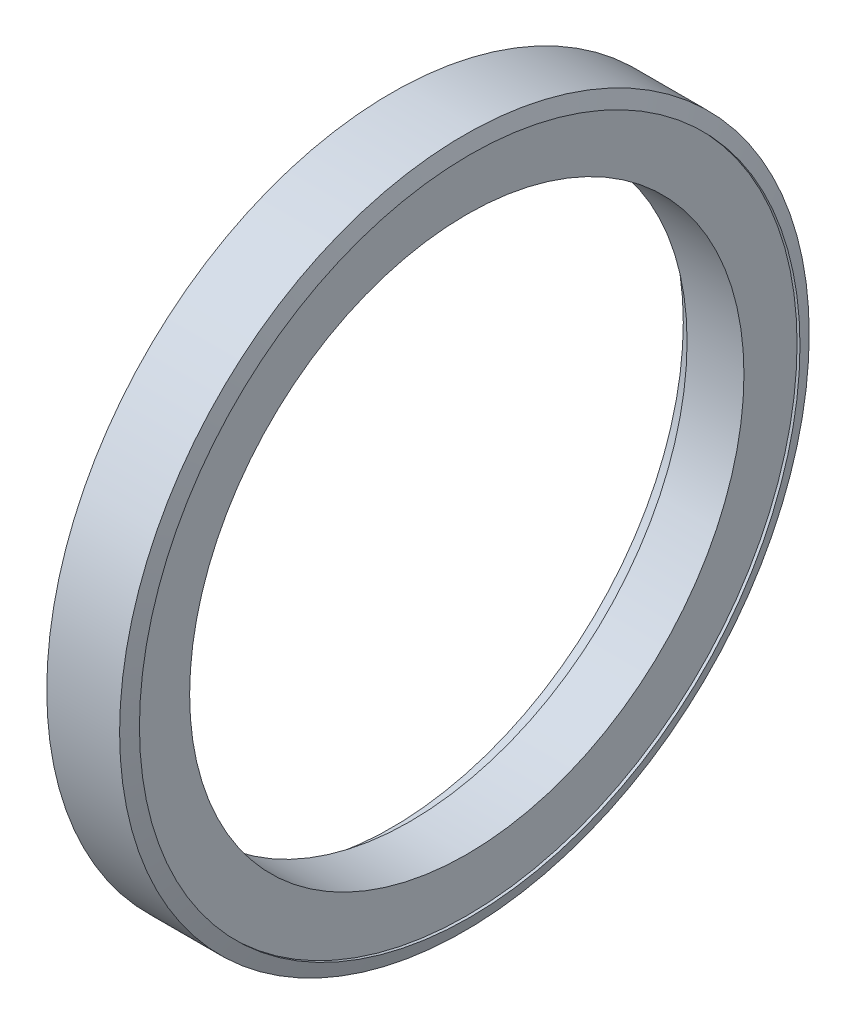
ISO-10303-21;
HEADER;
FILE_DESCRIPTION(('STEP AP214'),'2;1');
FILE_NAME('part.step','',(''),(''),'','','');
FILE_SCHEMA(('AUTOMOTIVE_DESIGN { 1 0 10303 214 1 1 1 1 }'));
ENDSEC;
DATA;
#1=APPLICATION_CONTEXT('core data for automotive mechanical design processes');
#2=APPLICATION_PROTOCOL_DEFINITION('international standard','automotive_design',2000,#1);
#3=PRODUCT_CONTEXT('',#1,'mechanical');
#4=PRODUCT('Part','Part','',(#3));
#5=PRODUCT_RELATED_PRODUCT_CATEGORY('part','',(#4));
#6=PRODUCT_DEFINITION_FORMATION('','',#4);
#7=PRODUCT_DEFINITION_CONTEXT('part definition',#1,'design');
#8=PRODUCT_DEFINITION('design','',#6,#7);
#9=PRODUCT_DEFINITION_SHAPE('','',#8);
#10=(LENGTH_UNIT() NAMED_UNIT(*) SI_UNIT(.MILLI.,.METRE.));
#11=(NAMED_UNIT(*) PLANE_ANGLE_UNIT() SI_UNIT($,.RADIAN.));
#12=(NAMED_UNIT(*) SI_UNIT($,.STERADIAN.) SOLID_ANGLE_UNIT());
#13=UNCERTAINTY_MEASURE_WITH_UNIT(LENGTH_MEASURE(1.E-05),#10,'distance_accuracy_value','');
#14=(GEOMETRIC_REPRESENTATION_CONTEXT(3) GLOBAL_UNCERTAINTY_ASSIGNED_CONTEXT((#13)) GLOBAL_UNIT_ASSIGNED_CONTEXT((#10,
#11,#12)) REPRESENTATION_CONTEXT('',''));
#15=CARTESIAN_POINT('',(0.,0.,0.));
#16=DIRECTION('',(0.,0.,1.));
#17=DIRECTION('',(1.,0.,0.));
#18=AXIS2_PLACEMENT_3D('',#15,#16,#17);
#19=CARTESIAN_POINT('',(8.16530000000087,0.,0.));
#20=DIRECTION('',(1.,0.,0.));
#21=DIRECTION('',(0.,0.,-1.));
#22=AXIS2_PLACEMENT_3D('',#19,#20,#21);
#23=CYLINDRICAL_SURFACE('',#22,48.3870000000008);
#24=CARTESIAN_POINT('',(13.1302000000009,0.,0.));
#25=DIRECTION('',(1.,0.,0.));
#26=DIRECTION('',(0.,0.,-1.));
#27=AXIS2_PLACEMENT_3D('',#24,#25,#26);
#28=CIRCLE('',#27,48.3870000000008);
#29=CARTESIAN_POINT('',(13.1302000000009,0.,-48.3870000000008));
#30=VERTEX_POINT('',#29);
#31=EDGE_CURVE('E18',#30,#30,#28,.F.);
#32=ORIENTED_EDGE('',*,*,#31,.F.);
#33=EDGE_LOOP('',(#32));
#34=FACE_BOUND('',#33,.T.);
#35=CARTESIAN_POINT('',(3.20040000000084,0.,0.));
#36=DIRECTION('',(1.,0.,0.));
#37=DIRECTION('',(0.,0.,-1.));
#38=AXIS2_PLACEMENT_3D('',#35,#36,#37);
#39=CIRCLE('',#38,48.3870000000008);
#40=CARTESIAN_POINT('',(3.20040000000084,0.,-48.3870000000008));
#41=VERTEX_POINT('',#40);
#42=EDGE_CURVE('E41',#41,#41,#39,.T.);
#43=ORIENTED_EDGE('',*,*,#42,.F.);
#44=EDGE_LOOP('',(#43));
#45=FACE_BOUND('',#44,.T.);
#46=ADVANCED_FACE('F15',(#34,#45),#23,.F.);
#47=CARTESIAN_POINT('',(13.1302000000009,53.0225000000004,0.));
#48=DIRECTION('',(1.,0.,0.));
#49=DIRECTION('',(0.,0.,-1.));
#50=AXIS2_PLACEMENT_3D('',#47,#48,#49);
#51=PLANE('',#50);
#52=ORIENTED_EDGE('',*,*,#31,.T.);
#53=EDGE_LOOP('',(#52));
#54=FACE_BOUND('',#53,.T.);
#55=CARTESIAN_POINT('',(13.1302000000009,0.,0.));
#56=DIRECTION('',(1.,0.,0.));
#57=DIRECTION('',(0.,0.,-1.));
#58=AXIS2_PLACEMENT_3D('',#55,#56,#57);
#59=CIRCLE('',#58,57.6580000000002);
#60=CARTESIAN_POINT('',(13.1302000000009,0.,-57.6580000000002));
#61=VERTEX_POINT('',#60);
#62=EDGE_CURVE('E39',#61,#61,#59,.T.);
#63=ORIENTED_EDGE('',*,*,#62,.T.);
#64=EDGE_LOOP('',(#63));
#65=FACE_BOUND('',#64,.T.);
#66=ADVANCED_FACE('F48',(#54,#65),#51,.T.);
#67=CARTESIAN_POINT('',(3.20040000000084,49.6570000000003,0.));
#68=DIRECTION('',(-1.,0.,0.));
#69=DIRECTION('',(0.,0.,1.));
#70=AXIS2_PLACEMENT_3D('',#67,#68,#69);
#71=PLANE('',#70);
#72=ORIENTED_EDGE('',*,*,#42,.T.);
#73=EDGE_LOOP('',(#72));
#74=FACE_BOUND('',#73,.T.);
#75=CARTESIAN_POINT('',(3.20040000000084,0.,0.));
#76=DIRECTION('',(1.,0.,0.));
#77=DIRECTION('',(0.,0.,-1.));
#78=AXIS2_PLACEMENT_3D('',#75,#76,#77);
#79=CIRCLE('',#78,50.9269999999999);
#80=CARTESIAN_POINT('',(3.20040000000084,0.,-50.9269999999999));
#81=VERTEX_POINT('',#80);
#82=EDGE_CURVE('E36',#81,#81,#79,.F.);
#83=ORIENTED_EDGE('',*,*,#82,.T.);
#84=EDGE_LOOP('',(#83));
#85=FACE_BOUND('',#84,.T.);
#86=ADVANCED_FACE('F57',(#74,#85),#71,.T.);
#87=CARTESIAN_POINT('',(13.3852000000009,0.,0.));
#88=DIRECTION('',(1.,0.,0.));
#89=DIRECTION('',(0.,0.,-1.));
#90=AXIS2_PLACEMENT_3D('',#87,#88,#89);
#91=CYLINDRICAL_SURFACE('',#90,57.6580000000002);
#92=CARTESIAN_POINT('',(13.640200001774,0.,0.));
#93=DIRECTION('',(-1.,0.,0.));
#94=DIRECTION('',(0.,1.,0.));
#95=AXIS2_PLACEMENT_3D('',#92,#93,#94);
#96=CIRCLE('',#95,57.6580000006455);
#97=CARTESIAN_POINT('',(13.640200001774,57.6580000006454,0.));
#98=VERTEX_POINT('',#97);
#99=EDGE_CURVE('E35',#98,#98,#96,.T.);
#100=ORIENTED_EDGE('',*,*,#99,.F.);
#101=EDGE_LOOP('',(#100));
#102=FACE_BOUND('',#101,.T.);
#103=ORIENTED_EDGE('',*,*,#62,.F.);
#104=EDGE_LOOP('',(#103));
#105=FACE_BOUND('',#104,.T.);
#106=ADVANCED_FACE('F76',(#102,#105),#91,.F.);
#107=CARTESIAN_POINT('',(1.60020000000043,0.,0.));
#108=DIRECTION('',(1.,0.,0.));
#109=DIRECTION('',(0.,0.,-1.));
#110=AXIS2_PLACEMENT_3D('',#107,#108,#109);
#111=CYLINDRICAL_SURFACE('',#110,50.9269999999999);
#112=ORIENTED_EDGE('',*,*,#82,.F.);
#113=EDGE_LOOP('',(#112));
#114=FACE_BOUND('',#113,.T.);
#115=CARTESIAN_POINT('',(0.,0.,0.));
#116=DIRECTION('',(1.,0.,0.));
#117=DIRECTION('',(0.,0.,-1.));
#118=AXIS2_PLACEMENT_3D('',#115,#116,#117);
#119=CIRCLE('',#118,50.9269999999999);
#120=CARTESIAN_POINT('',(0.,0.,-50.9269999999999));
#121=VERTEX_POINT('',#120);
#122=EDGE_CURVE('E27',#121,#121,#119,.T.);
#123=ORIENTED_EDGE('',*,*,#122,.F.);
#124=EDGE_LOOP('',(#123));
#125=FACE_BOUND('',#124,.T.);
#126=ADVANCED_FACE('F72',(#114,#125),#111,.F.);
#127=CARTESIAN_POINT('',(12.7157156031903,0.,0.));
#128=DIRECTION('',(-1.,0.,0.));
#129=DIRECTION('',(0.,0.,1.));
#130=AXIS2_PLACEMENT_3D('',#127,#128,#129);
#131=CONICAL_SURFACE('',#130,60.1979999993548,1.22173047499944);
#132=CARTESIAN_POINT('',(12.7157156049633,0.,0.));
#133=DIRECTION('',(1.,0.,0.));
#134=DIRECTION('',(0.,0.,-1.));
#135=AXIS2_PLACEMENT_3D('',#132,#133,#134);
#136=CIRCLE('',#135,60.1980000000001);
#137=CARTESIAN_POINT('',(12.7157156049633,0.,-60.1980000000001));
#138=VERTEX_POINT('',#137);
#139=EDGE_CURVE('E22',#138,#138,#136,.F.);
#140=ORIENTED_EDGE('',*,*,#139,.F.);
#141=EDGE_LOOP('',(#140));
#142=FACE_BOUND('',#141,.T.);
#143=ORIENTED_EDGE('',*,*,#99,.T.);
#144=EDGE_LOOP('',(#143));
#145=FACE_BOUND('',#144,.T.);
#146=ADVANCED_FACE('F65',(#142,#145),#131,.T.);
#147=CARTESIAN_POINT('',(0.,55.5625,0.));
#148=DIRECTION('',(-1.,0.,0.));
#149=DIRECTION('',(0.,0.,1.));
#150=AXIS2_PLACEMENT_3D('',#147,#148,#149);
#151=PLANE('',#150);
#152=ORIENTED_EDGE('',*,*,#122,.T.);
#153=EDGE_LOOP('',(#152));
#154=FACE_BOUND('',#153,.T.);
#155=CARTESIAN_POINT('',(0.,0.,0.));
#156=DIRECTION('',(1.,0.,0.));
#157=DIRECTION('',(0.,0.,-1.));
#158=AXIS2_PLACEMENT_3D('',#155,#156,#157);
#159=CIRCLE('',#158,60.1980000000001);
#160=CARTESIAN_POINT('',(0.,0.,-60.1980000000001));
#161=VERTEX_POINT('',#160);
#162=EDGE_CURVE('E10',#161,#161,#159,.T.);
#163=ORIENTED_EDGE('',*,*,#162,.F.);
#164=EDGE_LOOP('',(#163));
#165=FACE_BOUND('',#164,.T.);
#166=ADVANCED_FACE('F60',(#154,#165),#151,.T.);
#167=CARTESIAN_POINT('',(6.35785780248165,0.,0.));
#168=DIRECTION('',(1.,0.,0.));
#169=DIRECTION('',(0.,0.,-1.));
#170=AXIS2_PLACEMENT_3D('',#167,#168,#169);
#171=CYLINDRICAL_SURFACE('',#170,60.1980000000001);
#172=ORIENTED_EDGE('',*,*,#162,.T.);
#173=EDGE_LOOP('',(#172));
#174=FACE_BOUND('',#173,.T.);
#175=ORIENTED_EDGE('',*,*,#139,.T.);
#176=EDGE_LOOP('',(#175));
#177=FACE_BOUND('',#176,.T.);
#178=ADVANCED_FACE('F58',(#174,#177),#171,.T.);
#179=CLOSED_SHELL('',(#46,#66,#86,#106,#126,#146,#166,#178));
#180=MANIFOLD_SOLID_BREP('B1',#179);
#181=ADVANCED_BREP_SHAPE_REPRESENTATION('',(#18,#180),#14);
#182=SHAPE_DEFINITION_REPRESENTATION(#9,#181);
ENDSEC;
END-ISO-10303-21;
